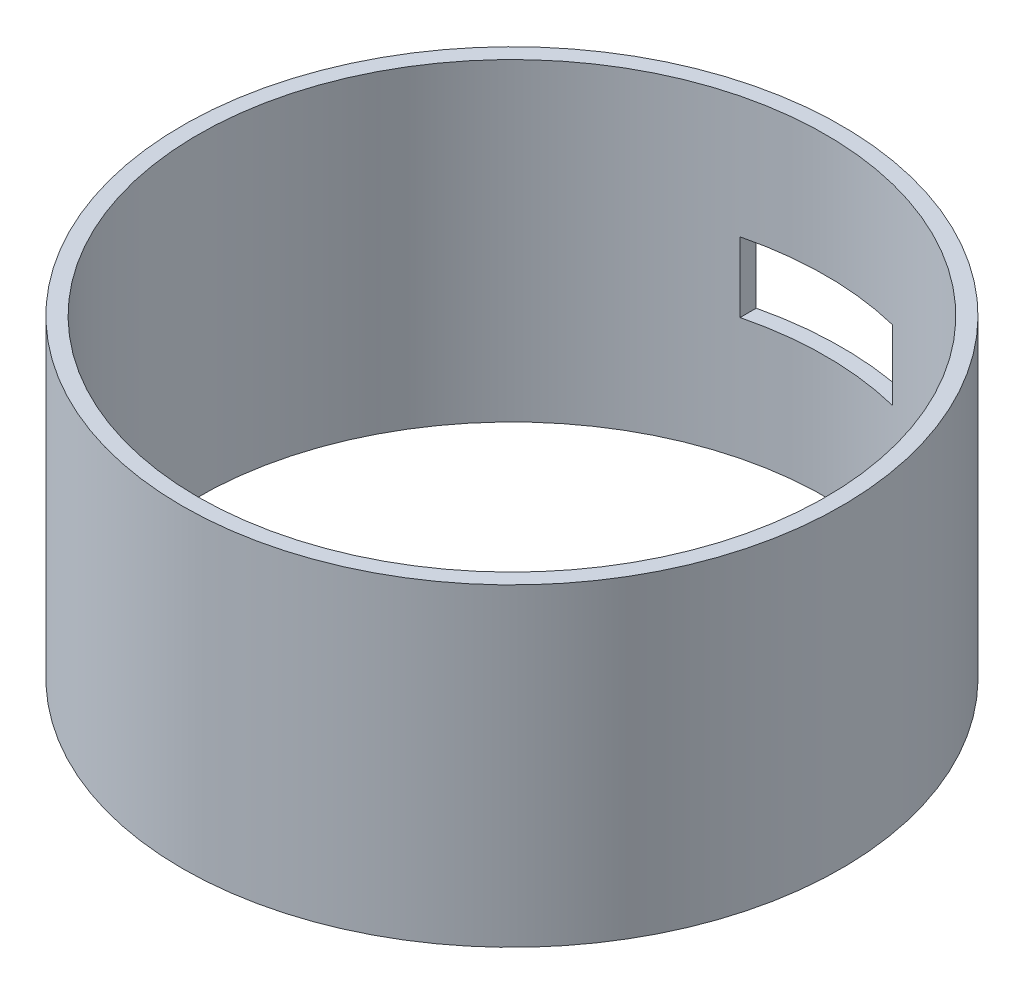
ISO-10303-21;
HEADER;
FILE_DESCRIPTION(('STEP AP214'),'2;1');
FILE_NAME('part.step','',(''),(''),'','','');
FILE_SCHEMA(('AUTOMOTIVE_DESIGN { 1 0 10303 214 1 1 1 1 }'));
ENDSEC;
DATA;
#1=APPLICATION_CONTEXT('core data for automotive mechanical design processes');
#2=APPLICATION_PROTOCOL_DEFINITION('international standard','automotive_design',2000,#1);
#3=PRODUCT_CONTEXT('',#1,'mechanical');
#4=PRODUCT('Part','Part','',(#3));
#5=PRODUCT_RELATED_PRODUCT_CATEGORY('part','',(#4));
#6=PRODUCT_DEFINITION_FORMATION('','',#4);
#7=PRODUCT_DEFINITION_CONTEXT('part definition',#1,'design');
#8=PRODUCT_DEFINITION('design','',#6,#7);
#9=PRODUCT_DEFINITION_SHAPE('','',#8);
#10=(LENGTH_UNIT() NAMED_UNIT(*) SI_UNIT(.MILLI.,.METRE.));
#11=(NAMED_UNIT(*) PLANE_ANGLE_UNIT() SI_UNIT($,.RADIAN.));
#12=(NAMED_UNIT(*) SI_UNIT($,.STERADIAN.) SOLID_ANGLE_UNIT());
#13=UNCERTAINTY_MEASURE_WITH_UNIT(LENGTH_MEASURE(1.E-05),#10,'distance_accuracy_value','');
#14=(GEOMETRIC_REPRESENTATION_CONTEXT(3) GLOBAL_UNCERTAINTY_ASSIGNED_CONTEXT((#13)) GLOBAL_UNIT_ASSIGNED_CONTEXT((#10,
#11,#12)) REPRESENTATION_CONTEXT('',''));
#15=CARTESIAN_POINT('',(0.,0.,0.));
#16=DIRECTION('',(0.,0.,1.));
#17=DIRECTION('',(1.,0.,0.));
#18=AXIS2_PLACEMENT_3D('',#15,#16,#17);
#19=CARTESIAN_POINT('',(0.,100.,0.));
#20=DIRECTION('',(0.,1.,0.));
#21=DIRECTION('',(0.,0.,1.));
#22=AXIS2_PLACEMENT_3D('',#19,#20,#21);
#23=PLANE('',#22);
#24=CARTESIAN_POINT('',(0.,100.,0.));
#25=DIRECTION('',(0.,1.,0.));
#26=DIRECTION('',(0.,0.,1.));
#27=AXIS2_PLACEMENT_3D('',#24,#25,#26);
#28=CIRCLE('',#27,105.);
#29=CARTESIAN_POINT('',(0.,100.,105.));
#30=VERTEX_POINT('',#29);
#31=EDGE_CURVE('E100',#30,#30,#28,.T.);
#32=ORIENTED_EDGE('',*,*,#31,.T.);
#33=EDGE_LOOP('',(#32));
#34=FACE_BOUND('',#33,.T.);
#35=CARTESIAN_POINT('',(0.,100.,0.));
#36=DIRECTION('',(0.,1.,0.));
#37=DIRECTION('',(0.,0.,1.));
#38=AXIS2_PLACEMENT_3D('',#35,#36,#37);
#39=CIRCLE('',#38,100.);
#40=CARTESIAN_POINT('',(0.,100.,100.));
#41=VERTEX_POINT('',#40);
#42=EDGE_CURVE('E92',#41,#41,#39,.T.);
#43=ORIENTED_EDGE('',*,*,#42,.F.);
#44=EDGE_LOOP('',(#43));
#45=FACE_BOUND('',#44,.T.);
#46=ADVANCED_FACE('F33',(#34,#45),#23,.T.);
#47=CARTESIAN_POINT('',(0.,0.,0.));
#48=DIRECTION('',(0.,1.,0.));
#49=DIRECTION('',(0.,0.,1.));
#50=AXIS2_PLACEMENT_3D('',#47,#48,#49);
#51=PLANE('',#50);
#52=CARTESIAN_POINT('',(0.,0.,0.));
#53=DIRECTION('',(0.,1.,0.));
#54=DIRECTION('',(0.,0.,1.));
#55=AXIS2_PLACEMENT_3D('',#52,#53,#54);
#56=CIRCLE('',#55,105.);
#57=CARTESIAN_POINT('',(0.,0.,105.));
#58=VERTEX_POINT('',#57);
#59=EDGE_CURVE('E98',#58,#58,#56,.T.);
#60=ORIENTED_EDGE('',*,*,#59,.F.);
#61=EDGE_LOOP('',(#60));
#62=FACE_BOUND('',#61,.T.);
#63=CARTESIAN_POINT('',(0.,0.,0.));
#64=DIRECTION('',(0.,1.,0.));
#65=DIRECTION('',(0.,0.,1.));
#66=AXIS2_PLACEMENT_3D('',#63,#64,#65);
#67=CIRCLE('',#66,100.);
#68=CARTESIAN_POINT('',(0.,0.,100.));
#69=VERTEX_POINT('',#68);
#70=EDGE_CURVE('E89',#69,#69,#67,.T.);
#71=ORIENTED_EDGE('',*,*,#70,.T.);
#72=EDGE_LOOP('',(#71));
#73=FACE_BOUND('',#72,.T.);
#74=ADVANCED_FACE('F132',(#62,#73),#51,.F.);
#75=CARTESIAN_POINT('',(0.,100.,0.));
#76=DIRECTION('',(0.,-1.,0.));
#77=DIRECTION('',(0.,0.,-1.));
#78=AXIS2_PLACEMENT_3D('',#75,#76,#77);
#79=CYLINDRICAL_SURFACE('',#78,105.);
#80=CARTESIAN_POINT('',(0.,61.127985538933,0.));
#81=DIRECTION('',(0.,1.,0.));
#82=DIRECTION('',(0.,0.,1.));
#83=AXIS2_PLACEMENT_3D('',#80,#81,#82);
#84=CIRCLE('',#83,105.);
#85=CARTESIAN_POINT('',(24.3103684081304,61.127985538933,-102.146982274862));
#86=VERTEX_POINT('',#85);
#87=CARTESIAN_POINT('',(-24.3103684081304,61.127985538933,-102.146982274862));
#88=VERTEX_POINT('',#87);
#89=EDGE_CURVE('E88',#86,#88,#84,.T.);
#90=ORIENTED_EDGE('',*,*,#89,.T.);
#91=DIRECTION('',(0.,-1.,0.));
#92=VECTOR('',#91,1.);
#93=CARTESIAN_POINT('',(-24.3103684081304,100.,-102.146982274862));
#94=LINE('',#93,#92);
#95=CARTESIAN_POINT('',(-24.3103684081304,38.872014461067,-102.146982274862));
#96=VERTEX_POINT('',#95);
#97=EDGE_CURVE('E81',#88,#96,#94,.T.);
#98=ORIENTED_EDGE('',*,*,#97,.T.);
#99=CARTESIAN_POINT('',(0.,38.872014461067,0.));
#100=DIRECTION('',(0.,-1.,0.));
#101=DIRECTION('',(0.,0.,-1.));
#102=AXIS2_PLACEMENT_3D('',#99,#100,#101);
#103=CIRCLE('',#102,105.);
#104=CARTESIAN_POINT('',(24.3103684081304,38.872014461067,-102.146982274862));
#105=VERTEX_POINT('',#104);
#106=EDGE_CURVE('E70',#96,#105,#103,.T.);
#107=ORIENTED_EDGE('',*,*,#106,.T.);
#108=DIRECTION('',(0.,-1.,0.));
#109=VECTOR('',#108,1.);
#110=CARTESIAN_POINT('',(24.3103684081304,100.,-102.146982274862));
#111=LINE('',#110,#109);
#112=EDGE_CURVE('E75',#105,#86,#111,.F.);
#113=ORIENTED_EDGE('',*,*,#112,.T.);
#114=EDGE_LOOP('',(#90,#98,#107,#113));
#115=FACE_BOUND('',#114,.T.);
#116=ORIENTED_EDGE('',*,*,#31,.F.);
#117=EDGE_LOOP('',(#116));
#118=FACE_BOUND('',#117,.T.);
#119=ORIENTED_EDGE('',*,*,#59,.T.);
#120=EDGE_LOOP('',(#119));
#121=FACE_BOUND('',#120,.T.);
#122=ADVANCED_FACE('F35',(#115,#118,#121),#79,.T.);
#123=CARTESIAN_POINT('',(0.,100.,0.));
#124=DIRECTION('',(0.,-1.,0.));
#125=DIRECTION('',(0.,0.,-1.));
#126=AXIS2_PLACEMENT_3D('',#123,#124,#125);
#127=CYLINDRICAL_SURFACE('',#126,100.);
#128=DIRECTION('',(0.,-1.,0.));
#129=VECTOR('',#128,1.);
#130=CARTESIAN_POINT('',(-24.3103684081304,100.,-97.0000308652579));
#131=LINE('',#130,#129);
#132=CARTESIAN_POINT('',(-24.3103684081304,61.127985538933,-97.0000308652579));
#133=VERTEX_POINT('',#132);
#134=CARTESIAN_POINT('',(-24.3103684081304,38.872014461067,-97.0000308652579));
#135=VERTEX_POINT('',#134);
#136=EDGE_CURVE('E11',#133,#135,#131,.T.);
#137=ORIENTED_EDGE('',*,*,#136,.F.);
#138=CARTESIAN_POINT('',(0.,61.127985538933,0.));
#139=DIRECTION('',(0.,1.,0.));
#140=DIRECTION('',(0.,0.,1.));
#141=AXIS2_PLACEMENT_3D('',#138,#139,#140);
#142=CIRCLE('',#141,100.);
#143=CARTESIAN_POINT('',(24.3103684081304,61.127985538933,-97.0000308652579));
#144=VERTEX_POINT('',#143);
#145=EDGE_CURVE('E41',#144,#133,#142,.T.);
#146=ORIENTED_EDGE('',*,*,#145,.F.);
#147=DIRECTION('',(0.,-1.,0.));
#148=VECTOR('',#147,1.);
#149=CARTESIAN_POINT('',(24.3103684081304,100.,-97.0000308652579));
#150=LINE('',#149,#148);
#151=CARTESIAN_POINT('',(24.3103684081304,38.872014461067,-97.0000308652579));
#152=VERTEX_POINT('',#151);
#153=EDGE_CURVE('E107',#152,#144,#150,.F.);
#154=ORIENTED_EDGE('',*,*,#153,.F.);
#155=CARTESIAN_POINT('',(0.,38.872014461067,0.));
#156=DIRECTION('',(0.,-1.,0.));
#157=DIRECTION('',(0.,0.,-1.));
#158=AXIS2_PLACEMENT_3D('',#155,#156,#157);
#159=CIRCLE('',#158,100.);
#160=EDGE_CURVE('E103',#135,#152,#159,.T.);
#161=ORIENTED_EDGE('',*,*,#160,.F.);
#162=EDGE_LOOP('',(#137,#146,#154,#161));
#163=FACE_BOUND('',#162,.T.);
#164=ORIENTED_EDGE('',*,*,#42,.T.);
#165=EDGE_LOOP('',(#164));
#166=FACE_BOUND('',#165,.T.);
#167=ORIENTED_EDGE('',*,*,#70,.F.);
#168=EDGE_LOOP('',(#167));
#169=FACE_BOUND('',#168,.T.);
#170=ADVANCED_FACE('F117',(#163,#166,#169),#127,.F.);
#171=CARTESIAN_POINT('',(-24.3103684081304,61.127985538933,-187.));
#172=DIRECTION('',(-1.,0.,0.));
#173=DIRECTION('',(0.,0.,1.));
#174=AXIS2_PLACEMENT_3D('',#171,#172,#173);
#175=PLANE('',#174);
#176=DIRECTION('',(0.,0.,1.));
#177=VECTOR('',#176,1.);
#178=CARTESIAN_POINT('',(-24.3103684081304,61.127985538933,-187.));
#179=LINE('',#178,#177);
#180=EDGE_CURVE('E76',#88,#133,#179,.T.);
#181=ORIENTED_EDGE('',*,*,#180,.T.);
#182=ORIENTED_EDGE('',*,*,#136,.T.);
#183=DIRECTION('',(0.,0.,1.));
#184=VECTOR('',#183,1.);
#185=CARTESIAN_POINT('',(-24.3103684081304,38.872014461067,-187.));
#186=LINE('',#185,#184);
#187=EDGE_CURVE('E53',#96,#135,#186,.T.);
#188=ORIENTED_EDGE('',*,*,#187,.F.);
#189=ORIENTED_EDGE('',*,*,#97,.F.);
#190=EDGE_LOOP('',(#181,#182,#188,#189));
#191=FACE_BOUND('',#190,.T.);
#192=ADVANCED_FACE('F80',(#191),#175,.F.);
#193=CARTESIAN_POINT('',(24.3103684081304,61.127985538933,-187.));
#194=DIRECTION('',(0.,1.,0.));
#195=DIRECTION('',(0.,0.,1.));
#196=AXIS2_PLACEMENT_3D('',#193,#194,#195);
#197=PLANE('',#196);
#198=DIRECTION('',(0.,0.,1.));
#199=VECTOR('',#198,1.);
#200=CARTESIAN_POINT('',(24.3103684081304,61.127985538933,-187.));
#201=LINE('',#200,#199);
#202=EDGE_CURVE('E113',#86,#144,#201,.T.);
#203=ORIENTED_EDGE('',*,*,#202,.T.);
#204=ORIENTED_EDGE('',*,*,#145,.T.);
#205=ORIENTED_EDGE('',*,*,#180,.F.);
#206=ORIENTED_EDGE('',*,*,#89,.F.);
#207=EDGE_LOOP('',(#203,#204,#205,#206));
#208=FACE_BOUND('',#207,.T.);
#209=ADVANCED_FACE('F111',(#208),#197,.F.);
#210=CARTESIAN_POINT('',(24.3103684081304,61.127985538933,-187.));
#211=DIRECTION('',(1.,0.,0.));
#212=DIRECTION('',(0.,0.,-1.));
#213=AXIS2_PLACEMENT_3D('',#210,#211,#212);
#214=PLANE('',#213);
#215=DIRECTION('',(0.,0.,1.));
#216=VECTOR('',#215,1.);
#217=CARTESIAN_POINT('',(24.3103684081304,38.872014461067,-187.));
#218=LINE('',#217,#216);
#219=EDGE_CURVE('E48',#105,#152,#218,.T.);
#220=ORIENTED_EDGE('',*,*,#219,.T.);
#221=ORIENTED_EDGE('',*,*,#153,.T.);
#222=ORIENTED_EDGE('',*,*,#202,.F.);
#223=ORIENTED_EDGE('',*,*,#112,.F.);
#224=EDGE_LOOP('',(#220,#221,#222,#223));
#225=FACE_BOUND('',#224,.T.);
#226=ADVANCED_FACE('F120',(#225),#214,.F.);
#227=CARTESIAN_POINT('',(24.3103684081304,38.872014461067,-187.));
#228=DIRECTION('',(0.,-1.,0.));
#229=DIRECTION('',(0.,0.,-1.));
#230=AXIS2_PLACEMENT_3D('',#227,#228,#229);
#231=PLANE('',#230);
#232=ORIENTED_EDGE('',*,*,#187,.T.);
#233=ORIENTED_EDGE('',*,*,#160,.T.);
#234=ORIENTED_EDGE('',*,*,#219,.F.);
#235=ORIENTED_EDGE('',*,*,#106,.F.);
#236=EDGE_LOOP('',(#232,#233,#234,#235));
#237=FACE_BOUND('',#236,.T.);
#238=ADVANCED_FACE('F71',(#237),#231,.F.);
#239=CLOSED_SHELL('',(#46,#74,#122,#170,#192,#209,#226,#238));
#240=MANIFOLD_SOLID_BREP('B2',#239);
#241=ADVANCED_BREP_SHAPE_REPRESENTATION('',(#18,#240),#14);
#242=SHAPE_DEFINITION_REPRESENTATION(#9,#241);
ENDSEC;
END-ISO-10303-21;
